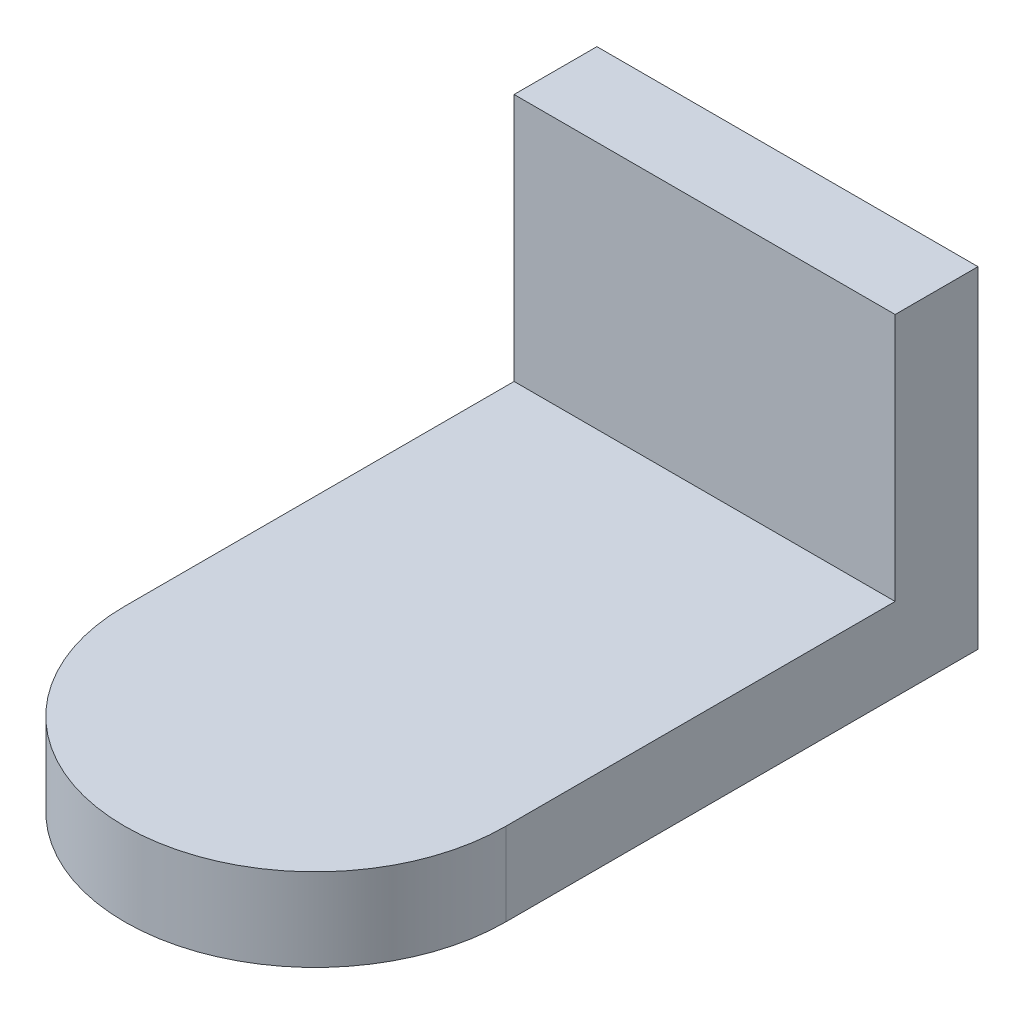
ISO-10303-21;
HEADER;
FILE_DESCRIPTION(('STEP AP214'),'2;1');
FILE_NAME('part.step','',(''),(''),'','','');
FILE_SCHEMA(('AUTOMOTIVE_DESIGN { 1 0 10303 214 1 1 1 1 }'));
ENDSEC;
DATA;
#1=APPLICATION_CONTEXT('core data for automotive mechanical design processes');
#2=APPLICATION_PROTOCOL_DEFINITION('international standard','automotive_design',2000,#1);
#3=PRODUCT_CONTEXT('',#1,'mechanical');
#4=PRODUCT('Part','Part','',(#3));
#5=PRODUCT_RELATED_PRODUCT_CATEGORY('part','',(#4));
#6=PRODUCT_DEFINITION_FORMATION('','',#4);
#7=PRODUCT_DEFINITION_CONTEXT('part definition',#1,'design');
#8=PRODUCT_DEFINITION('design','',#6,#7);
#9=PRODUCT_DEFINITION_SHAPE('','',#8);
#10=(LENGTH_UNIT() NAMED_UNIT(*) SI_UNIT(.MILLI.,.METRE.));
#11=(NAMED_UNIT(*) PLANE_ANGLE_UNIT() SI_UNIT($,.RADIAN.));
#12=(NAMED_UNIT(*) SI_UNIT($,.STERADIAN.) SOLID_ANGLE_UNIT());
#13=UNCERTAINTY_MEASURE_WITH_UNIT(LENGTH_MEASURE(1.E-05),#10,'distance_accuracy_value','');
#14=(GEOMETRIC_REPRESENTATION_CONTEXT(3) GLOBAL_UNCERTAINTY_ASSIGNED_CONTEXT((#13)) GLOBAL_UNIT_ASSIGNED_CONTEXT((#10,
#11,#12)) REPRESENTATION_CONTEXT('',''));
#15=CARTESIAN_POINT('',(0.,0.,0.));
#16=DIRECTION('',(0.,0.,1.));
#17=DIRECTION('',(1.,0.,0.));
#18=AXIS2_PLACEMENT_3D('',#15,#16,#17);
#19=CARTESIAN_POINT('',(-0.865,-0.2,-1.45));
#20=DIRECTION('',(-1.,0.,0.));
#21=DIRECTION('',(0.,0.,-1.));
#22=AXIS2_PLACEMENT_3D('',#19,#20,#21);
#23=PLANE('',#22);
#24=DIRECTION('',(0.,-1.,0.));
#25=VECTOR('',#24,1.);
#26=CARTESIAN_POINT('',(-0.865,-0.2,-1.5));
#27=LINE('',#26,#25);
#28=CARTESIAN_POINT('',(-0.865,-0.2,-1.5));
#29=VERTEX_POINT('',#28);
#30=CARTESIAN_POINT('',(-0.865,-0.4,-1.5));
#31=VERTEX_POINT('',#30);
#32=EDGE_CURVE('E11',#29,#31,#27,.T.);
#33=ORIENTED_EDGE('',*,*,#32,.T.);
#34=DIRECTION('',(0.,0.,-1.));
#35=VECTOR('',#34,1.);
#36=CARTESIAN_POINT('',(-0.865,-0.4,-1.45));
#37=LINE('',#36,#35);
#38=CARTESIAN_POINT('',(-0.865,-0.4,-1.215));
#39=VERTEX_POINT('',#38);
#40=EDGE_CURVE('E24',#39,#31,#37,.T.);
#41=ORIENTED_EDGE('',*,*,#40,.F.);
#42=DIRECTION('',(0.,-1.,0.));
#43=VECTOR('',#42,1.);
#44=CARTESIAN_POINT('',(-0.865,-0.35,-1.215));
#45=LINE('',#44,#43);
#46=CARTESIAN_POINT('',(-0.865,-0.35,-1.215));
#47=VERTEX_POINT('',#46);
#48=EDGE_CURVE('E86',#47,#39,#45,.T.);
#49=ORIENTED_EDGE('',*,*,#48,.F.);
#50=DIRECTION('',(0.,0.,1.));
#51=VECTOR('',#50,1.);
#52=CARTESIAN_POINT('',(-0.865,-0.35,-1.45));
#53=LINE('',#52,#51);
#54=CARTESIAN_POINT('',(-0.865,-0.35,-1.45));
#55=VERTEX_POINT('',#54);
#56=EDGE_CURVE('E115',#55,#47,#53,.T.);
#57=ORIENTED_EDGE('',*,*,#56,.F.);
#58=DIRECTION('',(0.,-1.,0.));
#59=VECTOR('',#58,1.);
#60=CARTESIAN_POINT('',(-0.865,-0.2,-1.45));
#61=LINE('',#60,#59);
#62=CARTESIAN_POINT('',(-0.865,-0.2,-1.45));
#63=VERTEX_POINT('',#62);
#64=EDGE_CURVE('E112',#63,#55,#61,.T.);
#65=ORIENTED_EDGE('',*,*,#64,.F.);
#66=DIRECTION('',(0.,0.,-1.));
#67=VECTOR('',#66,1.);
#68=CARTESIAN_POINT('',(-0.865,-0.2,-1.45));
#69=LINE('',#68,#67);
#70=EDGE_CURVE('E110',#63,#29,#69,.T.);
#71=ORIENTED_EDGE('',*,*,#70,.T.);
#72=EDGE_LOOP('',(#33,#41,#49,#57,#65,#71));
#73=FACE_BOUND('',#72,.T.);
#74=ADVANCED_FACE('F17',(#73),#23,.T.);
#75=CARTESIAN_POINT('',(-0.865,-0.2,-1.45));
#76=DIRECTION('',(0.,1.,0.));
#77=DIRECTION('',(-1.,0.,0.));
#78=AXIS2_PLACEMENT_3D('',#75,#76,#77);
#79=PLANE('',#78);
#80=DIRECTION('',(-1.,0.,0.));
#81=VECTOR('',#80,1.);
#82=CARTESIAN_POINT('',(-0.865,-0.2,-1.5));
#83=LINE('',#82,#81);
#84=CARTESIAN_POINT('',(-0.635,-0.2,-1.5));
#85=VERTEX_POINT('',#84);
#86=EDGE_CURVE('E107',#85,#29,#83,.T.);
#87=ORIENTED_EDGE('',*,*,#86,.T.);
#88=ORIENTED_EDGE('',*,*,#70,.F.);
#89=DIRECTION('',(-1.,0.,0.));
#90=VECTOR('',#89,1.);
#91=CARTESIAN_POINT('',(-0.865,-0.2,-1.45));
#92=LINE('',#91,#90);
#93=CARTESIAN_POINT('',(-0.635,-0.2,-1.45));
#94=VERTEX_POINT('',#93);
#95=EDGE_CURVE('E104',#94,#63,#92,.T.);
#96=ORIENTED_EDGE('',*,*,#95,.F.);
#97=DIRECTION('',(0.,0.,-1.));
#98=VECTOR('',#97,1.);
#99=CARTESIAN_POINT('',(-0.635,-0.2,-1.45));
#100=LINE('',#99,#98);
#101=EDGE_CURVE('E101',#94,#85,#100,.T.);
#102=ORIENTED_EDGE('',*,*,#101,.T.);
#103=EDGE_LOOP('',(#87,#88,#96,#102));
#104=FACE_BOUND('',#103,.T.);
#105=ADVANCED_FACE('F127',(#104),#79,.T.);
#106=CARTESIAN_POINT('',(-0.635,-0.2,-1.45));
#107=DIRECTION('',(1.,0.,0.));
#108=DIRECTION('',(0.,0.,1.));
#109=AXIS2_PLACEMENT_3D('',#106,#107,#108);
#110=PLANE('',#109);
#111=DIRECTION('',(0.,1.,0.));
#112=VECTOR('',#111,1.);
#113=CARTESIAN_POINT('',(-0.635,-0.2,-1.5));
#114=LINE('',#113,#112);
#115=CARTESIAN_POINT('',(-0.635,-0.4,-1.5));
#116=VERTEX_POINT('',#115);
#117=EDGE_CURVE('E99',#116,#85,#114,.T.);
#118=ORIENTED_EDGE('',*,*,#117,.T.);
#119=ORIENTED_EDGE('',*,*,#101,.F.);
#120=DIRECTION('',(0.,1.,0.));
#121=VECTOR('',#120,1.);
#122=CARTESIAN_POINT('',(-0.635,-0.2,-1.45));
#123=LINE('',#122,#121);
#124=CARTESIAN_POINT('',(-0.635,-0.35,-1.45));
#125=VERTEX_POINT('',#124);
#126=EDGE_CURVE('E96',#125,#94,#123,.T.);
#127=ORIENTED_EDGE('',*,*,#126,.F.);
#128=DIRECTION('',(0.,0.,-1.));
#129=VECTOR('',#128,1.);
#130=CARTESIAN_POINT('',(-0.635,-0.35,-1.45));
#131=LINE('',#130,#129);
#132=CARTESIAN_POINT('',(-0.635,-0.35,-1.215));
#133=VERTEX_POINT('',#132);
#134=EDGE_CURVE('E72',#133,#125,#131,.T.);
#135=ORIENTED_EDGE('',*,*,#134,.F.);
#136=DIRECTION('',(0.,-1.,0.));
#137=VECTOR('',#136,1.);
#138=CARTESIAN_POINT('',(-0.635,-0.35,-1.215));
#139=LINE('',#138,#137);
#140=CARTESIAN_POINT('',(-0.635,-0.4,-1.215));
#141=VERTEX_POINT('',#140);
#142=EDGE_CURVE('E65',#133,#141,#139,.T.);
#143=ORIENTED_EDGE('',*,*,#142,.T.);
#144=DIRECTION('',(0.,0.,-1.));
#145=VECTOR('',#144,1.);
#146=CARTESIAN_POINT('',(-0.635,-0.4,-1.45));
#147=LINE('',#146,#145);
#148=EDGE_CURVE('E69',#141,#116,#147,.T.);
#149=ORIENTED_EDGE('',*,*,#148,.T.);
#150=EDGE_LOOP('',(#118,#119,#127,#135,#143,#149));
#151=FACE_BOUND('',#150,.T.);
#152=ADVANCED_FACE('F68',(#151),#110,.T.);
#153=CARTESIAN_POINT('',(-0.865,-0.4,-1.45));
#154=DIRECTION('',(0.,-1.,0.));
#155=DIRECTION('',(1.,0.,0.));
#156=AXIS2_PLACEMENT_3D('',#153,#154,#155);
#157=PLANE('',#156);
#158=DIRECTION('',(1.,0.,0.));
#159=VECTOR('',#158,1.);
#160=CARTESIAN_POINT('',(-0.865,-0.4,-1.5));
#161=LINE('',#160,#159);
#162=EDGE_CURVE('E82',#31,#116,#161,.T.);
#163=ORIENTED_EDGE('',*,*,#162,.T.);
#164=ORIENTED_EDGE('',*,*,#148,.F.);
#165=CARTESIAN_POINT('',(-0.75,-0.4,-1.215));
#166=DIRECTION('',(0.,1.,0.));
#167=DIRECTION('',(1.,0.,0.));
#168=AXIS2_PLACEMENT_3D('',#165,#166,#167);
#169=CIRCLE('',#168,0.115);
#170=EDGE_CURVE('E81',#39,#141,#169,.T.);
#171=ORIENTED_EDGE('',*,*,#170,.F.);
#172=ORIENTED_EDGE('',*,*,#40,.T.);
#173=EDGE_LOOP('',(#163,#164,#171,#172));
#174=FACE_BOUND('',#173,.T.);
#175=ADVANCED_FACE('F80',(#174),#157,.T.);
#176=CARTESIAN_POINT('',(0.,0.,-1.45));
#177=DIRECTION('',(0.,0.,-1.));
#178=DIRECTION('',(1.,0.,0.));
#179=AXIS2_PLACEMENT_3D('',#176,#177,#178);
#180=PLANE('',#179);
#181=ORIENTED_EDGE('',*,*,#126,.T.);
#182=ORIENTED_EDGE('',*,*,#95,.T.);
#183=ORIENTED_EDGE('',*,*,#64,.T.);
#184=DIRECTION('',(-1.,0.,0.));
#185=VECTOR('',#184,1.);
#186=CARTESIAN_POINT('',(-0.865,-0.35,-1.45));
#187=LINE('',#186,#185);
#188=EDGE_CURVE('E87',#125,#55,#187,.T.);
#189=ORIENTED_EDGE('',*,*,#188,.F.);
#190=EDGE_LOOP('',(#181,#182,#183,#189));
#191=FACE_BOUND('',#190,.T.);
#192=ADVANCED_FACE('F123',(#191),#180,.F.);
#193=CARTESIAN_POINT('',(0.,0.,-1.5));
#194=DIRECTION('',(0.,0.,-1.));
#195=DIRECTION('',(1.,0.,0.));
#196=AXIS2_PLACEMENT_3D('',#193,#194,#195);
#197=PLANE('',#196);
#198=ORIENTED_EDGE('',*,*,#32,.F.);
#199=ORIENTED_EDGE('',*,*,#86,.F.);
#200=ORIENTED_EDGE('',*,*,#117,.F.);
#201=ORIENTED_EDGE('',*,*,#162,.F.);
#202=EDGE_LOOP('',(#198,#199,#200,#201));
#203=FACE_BOUND('',#202,.T.);
#204=ADVANCED_FACE('F118',(#203),#197,.T.);
#205=CARTESIAN_POINT('',(-0.75,-0.35,-1.215));
#206=DIRECTION('',(0.,-1.,0.));
#207=DIRECTION('',(1.,0.,0.));
#208=AXIS2_PLACEMENT_3D('',#205,#206,#207);
#209=CYLINDRICAL_SURFACE('',#208,0.115);
#210=ORIENTED_EDGE('',*,*,#170,.T.);
#211=ORIENTED_EDGE('',*,*,#142,.F.);
#212=CARTESIAN_POINT('',(-0.75,-0.35,-1.215));
#213=DIRECTION('',(0.,1.,0.));
#214=DIRECTION('',(1.,0.,0.));
#215=AXIS2_PLACEMENT_3D('',#212,#213,#214);
#216=CIRCLE('',#215,0.115);
#217=EDGE_CURVE('E91',#47,#133,#216,.T.);
#218=ORIENTED_EDGE('',*,*,#217,.F.);
#219=ORIENTED_EDGE('',*,*,#48,.T.);
#220=EDGE_LOOP('',(#210,#211,#218,#219));
#221=FACE_BOUND('',#220,.T.);
#222=ADVANCED_FACE('F85',(#221),#209,.T.);
#223=CARTESIAN_POINT('',(-0.75,-0.35,-1.215));
#224=DIRECTION('',(0.,-1.,0.));
#225=DIRECTION('',(1.,0.,0.));
#226=AXIS2_PLACEMENT_3D('',#223,#224,#225);
#227=PLANE('',#226);
#228=ORIENTED_EDGE('',*,*,#56,.T.);
#229=ORIENTED_EDGE('',*,*,#217,.T.);
#230=ORIENTED_EDGE('',*,*,#134,.T.);
#231=ORIENTED_EDGE('',*,*,#188,.T.);
#232=EDGE_LOOP('',(#228,#229,#230,#231));
#233=FACE_BOUND('',#232,.T.);
#234=ADVANCED_FACE('F125',(#233),#227,.F.);
#235=CLOSED_SHELL('',(#74,#105,#152,#175,#192,#204,#222,#234));
#236=MANIFOLD_SOLID_BREP('B1',#235);
#237=ADVANCED_BREP_SHAPE_REPRESENTATION('',(#18,#236),#14);
#238=SHAPE_DEFINITION_REPRESENTATION(#9,#237);
ENDSEC;
END-ISO-10303-21;
